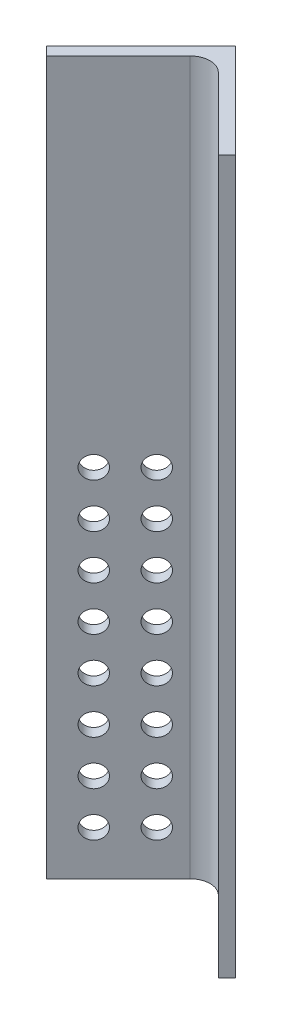
ISO-10303-21;
HEADER;
FILE_DESCRIPTION(('STEP AP214'),'2;1');
FILE_NAME('part.step','',(''),(''),'','','');
FILE_SCHEMA(('AUTOMOTIVE_DESIGN { 1 0 10303 214 1 1 1 1 }'));
ENDSEC;
DATA;
#1=APPLICATION_CONTEXT('core data for automotive mechanical design processes');
#2=APPLICATION_PROTOCOL_DEFINITION('international standard','automotive_design',2000,#1);
#3=PRODUCT_CONTEXT('',#1,'mechanical');
#4=PRODUCT('Part','Part','',(#3));
#5=PRODUCT_RELATED_PRODUCT_CATEGORY('part','',(#4));
#6=PRODUCT_DEFINITION_FORMATION('','',#4);
#7=PRODUCT_DEFINITION_CONTEXT('part definition',#1,'design');
#8=PRODUCT_DEFINITION('design','',#6,#7);
#9=PRODUCT_DEFINITION_SHAPE('','',#8);
#10=(LENGTH_UNIT() NAMED_UNIT(*) SI_UNIT(.MILLI.,.METRE.));
#11=(NAMED_UNIT(*) PLANE_ANGLE_UNIT() SI_UNIT($,.RADIAN.));
#12=(NAMED_UNIT(*) SI_UNIT($,.STERADIAN.) SOLID_ANGLE_UNIT());
#13=UNCERTAINTY_MEASURE_WITH_UNIT(LENGTH_MEASURE(1.E-05),#10,'distance_accuracy_value','');
#14=(GEOMETRIC_REPRESENTATION_CONTEXT(3) GLOBAL_UNCERTAINTY_ASSIGNED_CONTEXT((#13)) GLOBAL_UNIT_ASSIGNED_CONTEXT((#10,
#11,#12)) REPRESENTATION_CONTEXT('',''));
#15=CARTESIAN_POINT('',(0.,0.,0.));
#16=DIRECTION('',(0.,0.,1.));
#17=DIRECTION('',(1.,0.,0.));
#18=AXIS2_PLACEMENT_3D('',#15,#16,#17);
#19=CARTESIAN_POINT('',(26.9407683632075,101.6,26.9407683632075));
#20=DIRECTION('',(-0.707106781186548,0.,0.707106781186547));
#21=DIRECTION('',(0.707106781186547,0.,0.707106781186548));
#22=AXIS2_PLACEMENT_3D('',#19,#20,#21);
#23=PLANE('',#22);
#24=DIRECTION('',(-0.707106781186547,0.,-0.707106781186548));
#25=VECTOR('',#24,1.);
#26=CARTESIAN_POINT('',(26.9407683632075,-101.6,26.9407683632075));
#27=LINE('',#26,#25);
#28=CARTESIAN_POINT('',(26.9407683632075,-101.6,26.9407683632075));
#29=VERTEX_POINT('',#28);
#30=CARTESIAN_POINT('',(0.,-101.6,0.));
#31=VERTEX_POINT('',#30);
#32=EDGE_CURVE('E118',#29,#31,#27,.T.);
#33=ORIENTED_EDGE('',*,*,#32,.T.);
#34=DIRECTION('',(0.,-1.,0.));
#35=VECTOR('',#34,1.);
#36=CARTESIAN_POINT('',(0.,101.6,0.));
#37=LINE('',#36,#35);
#38=CARTESIAN_POINT('',(0.,101.6,0.));
#39=VERTEX_POINT('',#38);
#40=EDGE_CURVE('E99',#39,#31,#37,.T.);
#41=ORIENTED_EDGE('',*,*,#40,.F.);
#42=DIRECTION('',(-0.707106781186547,0.,-0.707106781186548));
#43=VECTOR('',#42,1.);
#44=CARTESIAN_POINT('',(26.9407683632075,101.6,26.9407683632075));
#45=LINE('',#44,#43);
#46=CARTESIAN_POINT('',(26.9407683632075,101.6,26.9407683632075));
#47=VERTEX_POINT('',#46);
#48=EDGE_CURVE('E106',#47,#39,#45,.T.);
#49=ORIENTED_EDGE('',*,*,#48,.F.);
#50=DIRECTION('',(0.,-1.,0.));
#51=VECTOR('',#50,1.);
#52=CARTESIAN_POINT('',(26.9407683632075,101.6,26.9407683632075));
#53=LINE('',#52,#51);
#54=EDGE_CURVE('E464',#47,#29,#53,.T.);
#55=ORIENTED_EDGE('',*,*,#54,.T.);
#56=EDGE_LOOP('',(#33,#41,#49,#55));
#57=FACE_BOUND('',#56,.T.);
#58=ADVANCED_FACE('F33',(#57),#23,.F.);
#59=CARTESIAN_POINT('',(0.,101.6,0.));
#60=DIRECTION('',(0.707106781186547,0.,0.707106781186548));
#61=DIRECTION('',(0.707106781186548,0.,-0.707106781186547));
#62=AXIS2_PLACEMENT_3D('',#59,#60,#61);
#63=PLANE('',#62);
#64=CARTESIAN_POINT('',(-11.2253201513364,0.,11.2253201513364));
#65=DIRECTION('',(0.707106781186547,0.,0.707106781186548));
#66=DIRECTION('',(0.707106781186548,0.,-0.707106781186547));
#67=AXIS2_PLACEMENT_3D('',#64,#65,#66);
#68=CIRCLE('',#67,3.17499999999999);
#69=CARTESIAN_POINT('',(-8.98025612106916,0.,8.98025612106915));
#70=VERTEX_POINT('',#69);
#71=EDGE_CURVE('E502',#70,#70,#68,.T.);
#72=ORIENTED_EDGE('',*,*,#71,.T.);
#73=EDGE_LOOP('',(#72));
#74=FACE_BOUND('',#73,.T.);
#75=CARTESIAN_POINT('',(-20.2055762724056,0.,20.2055762724056));
#76=DIRECTION('',(0.707106781186547,0.,0.707106781186548));
#77=DIRECTION('',(0.707106781186548,0.,-0.707106781186547));
#78=AXIS2_PLACEMENT_3D('',#75,#76,#77);
#79=CIRCLE('',#78,3.17499999999999);
#80=CARTESIAN_POINT('',(-17.9605122421383,0.,17.9605122421383));
#81=VERTEX_POINT('',#80);
#82=EDGE_CURVE('E472',#81,#81,#79,.T.);
#83=ORIENTED_EDGE('',*,*,#82,.T.);
#84=EDGE_LOOP('',(#83));
#85=FACE_BOUND('',#84,.T.);
#86=DIRECTION('',(-0.707106781186548,0.,0.707106781186547));
#87=VECTOR('',#86,1.);
#88=CARTESIAN_POINT('',(0.,-101.6,0.));
#89=LINE('',#88,#87);
#90=CARTESIAN_POINT('',(-26.9407683632075,-101.6,26.9407683632075));
#91=VERTEX_POINT('',#90);
#92=EDGE_CURVE('E471',#31,#91,#89,.T.);
#93=ORIENTED_EDGE('',*,*,#92,.T.);
#94=DIRECTION('',(0.,-1.,0.));
#95=VECTOR('',#94,1.);
#96=CARTESIAN_POINT('',(-26.9407683632075,101.6,26.9407683632075));
#97=LINE('',#96,#95);
#98=CARTESIAN_POINT('',(-26.9407683632075,101.6,26.9407683632075));
#99=VERTEX_POINT('',#98);
#100=EDGE_CURVE('E102',#99,#91,#97,.T.);
#101=ORIENTED_EDGE('',*,*,#100,.F.);
#102=DIRECTION('',(-0.707106781186548,0.,0.707106781186547));
#103=VECTOR('',#102,1.);
#104=CARTESIAN_POINT('',(0.,101.6,0.));
#105=LINE('',#104,#103);
#106=EDGE_CURVE('E94',#39,#99,#105,.T.);
#107=ORIENTED_EDGE('',*,*,#106,.F.);
#108=ORIENTED_EDGE('',*,*,#40,.T.);
#109=EDGE_LOOP('',(#93,#101,#107,#108));
#110=FACE_BOUND('',#109,.T.);
#111=CARTESIAN_POINT('',(-20.2055762724056,-12.7,20.2055762724056));
#112=DIRECTION('',(0.707106781186547,0.,0.707106781186548));
#113=DIRECTION('',(0.707106781186548,0.,-0.707106781186547));
#114=AXIS2_PLACEMENT_3D('',#111,#112,#113);
#115=CIRCLE('',#114,3.17499999999999);
#116=CARTESIAN_POINT('',(-17.9605122421383,-12.7,17.9605122421383));
#117=VERTEX_POINT('',#116);
#118=EDGE_CURVE('E131',#117,#117,#115,.T.);
#119=ORIENTED_EDGE('',*,*,#118,.T.);
#120=EDGE_LOOP('',(#119));
#121=FACE_BOUND('',#120,.T.);
#122=CARTESIAN_POINT('',(-11.2253201513364,-12.7,11.2253201513364));
#123=DIRECTION('',(0.707106781186547,0.,0.707106781186548));
#124=DIRECTION('',(0.707106781186548,0.,-0.707106781186547));
#125=AXIS2_PLACEMENT_3D('',#122,#123,#124);
#126=CIRCLE('',#125,3.17499999999999);
#127=CARTESIAN_POINT('',(-8.98025612106916,-12.7,8.98025612106915));
#128=VERTEX_POINT('',#127);
#129=EDGE_CURVE('E137',#128,#128,#126,.T.);
#130=ORIENTED_EDGE('',*,*,#129,.T.);
#131=EDGE_LOOP('',(#130));
#132=FACE_BOUND('',#131,.T.);
#133=CARTESIAN_POINT('',(-20.2055762724056,-25.4,20.2055762724056));
#134=DIRECTION('',(0.707106781186547,0.,0.707106781186548));
#135=DIRECTION('',(0.707106781186548,0.,-0.707106781186547));
#136=AXIS2_PLACEMENT_3D('',#133,#134,#135);
#137=CIRCLE('',#136,3.17499999999999);
#138=CARTESIAN_POINT('',(-17.9605122421383,-25.4,17.9605122421383));
#139=VERTEX_POINT('',#138);
#140=EDGE_CURVE('E143',#139,#139,#137,.T.);
#141=ORIENTED_EDGE('',*,*,#140,.T.);
#142=EDGE_LOOP('',(#141));
#143=FACE_BOUND('',#142,.T.);
#144=CARTESIAN_POINT('',(-11.2253201513364,-25.4,11.2253201513364));
#145=DIRECTION('',(0.707106781186547,0.,0.707106781186548));
#146=DIRECTION('',(0.707106781186548,0.,-0.707106781186547));
#147=AXIS2_PLACEMENT_3D('',#144,#145,#146);
#148=CIRCLE('',#147,3.17499999999999);
#149=CARTESIAN_POINT('',(-8.98025612106916,-25.4,8.98025612106915));
#150=VERTEX_POINT('',#149);
#151=EDGE_CURVE('E149',#150,#150,#148,.T.);
#152=ORIENTED_EDGE('',*,*,#151,.T.);
#153=EDGE_LOOP('',(#152));
#154=FACE_BOUND('',#153,.T.);
#155=CARTESIAN_POINT('',(-20.2055762724056,-38.1,20.2055762724056));
#156=DIRECTION('',(0.707106781186547,0.,0.707106781186548));
#157=DIRECTION('',(0.707106781186548,0.,-0.707106781186547));
#158=AXIS2_PLACEMENT_3D('',#155,#156,#157);
#159=CIRCLE('',#158,3.17499999999999);
#160=CARTESIAN_POINT('',(-17.9605122421383,-38.1,17.9605122421383));
#161=VERTEX_POINT('',#160);
#162=EDGE_CURVE('E155',#161,#161,#159,.T.);
#163=ORIENTED_EDGE('',*,*,#162,.T.);
#164=EDGE_LOOP('',(#163));
#165=FACE_BOUND('',#164,.T.);
#166=CARTESIAN_POINT('',(-11.2253201513364,-38.1,11.2253201513364));
#167=DIRECTION('',(0.707106781186547,0.,0.707106781186548));
#168=DIRECTION('',(0.707106781186548,0.,-0.707106781186547));
#169=AXIS2_PLACEMENT_3D('',#166,#167,#168);
#170=CIRCLE('',#169,3.17499999999999);
#171=CARTESIAN_POINT('',(-8.98025612106916,-38.1,8.98025612106915));
#172=VERTEX_POINT('',#171);
#173=EDGE_CURVE('E161',#172,#172,#170,.T.);
#174=ORIENTED_EDGE('',*,*,#173,.T.);
#175=EDGE_LOOP('',(#174));
#176=FACE_BOUND('',#175,.T.);
#177=CARTESIAN_POINT('',(-20.2055762724056,-50.8,20.2055762724056));
#178=DIRECTION('',(0.707106781186547,0.,0.707106781186548));
#179=DIRECTION('',(0.707106781186548,0.,-0.707106781186547));
#180=AXIS2_PLACEMENT_3D('',#177,#178,#179);
#181=CIRCLE('',#180,3.17499999999999);
#182=CARTESIAN_POINT('',(-17.9605122421383,-50.8,17.9605122421383));
#183=VERTEX_POINT('',#182);
#184=EDGE_CURVE('E167',#183,#183,#181,.T.);
#185=ORIENTED_EDGE('',*,*,#184,.T.);
#186=EDGE_LOOP('',(#185));
#187=FACE_BOUND('',#186,.T.);
#188=CARTESIAN_POINT('',(-11.2253201513364,-50.8,11.2253201513364));
#189=DIRECTION('',(0.707106781186547,0.,0.707106781186548));
#190=DIRECTION('',(0.707106781186548,0.,-0.707106781186547));
#191=AXIS2_PLACEMENT_3D('',#188,#189,#190);
#192=CIRCLE('',#191,3.17499999999999);
#193=CARTESIAN_POINT('',(-8.98025612106916,-50.8,8.98025612106915));
#194=VERTEX_POINT('',#193);
#195=EDGE_CURVE('E173',#194,#194,#192,.T.);
#196=ORIENTED_EDGE('',*,*,#195,.T.);
#197=EDGE_LOOP('',(#196));
#198=FACE_BOUND('',#197,.T.);
#199=CARTESIAN_POINT('',(-20.2055762724056,-63.5,20.2055762724056));
#200=DIRECTION('',(0.707106781186547,0.,0.707106781186548));
#201=DIRECTION('',(0.707106781186548,0.,-0.707106781186547));
#202=AXIS2_PLACEMENT_3D('',#199,#200,#201);
#203=CIRCLE('',#202,3.17499999999999);
#204=CARTESIAN_POINT('',(-17.9605122421383,-63.5,17.9605122421383));
#205=VERTEX_POINT('',#204);
#206=EDGE_CURVE('E179',#205,#205,#203,.T.);
#207=ORIENTED_EDGE('',*,*,#206,.T.);
#208=EDGE_LOOP('',(#207));
#209=FACE_BOUND('',#208,.T.);
#210=CARTESIAN_POINT('',(-11.2253201513364,-63.5,11.2253201513364));
#211=DIRECTION('',(0.707106781186547,0.,0.707106781186548));
#212=DIRECTION('',(0.707106781186548,0.,-0.707106781186547));
#213=AXIS2_PLACEMENT_3D('',#210,#211,#212);
#214=CIRCLE('',#213,3.17499999999999);
#215=CARTESIAN_POINT('',(-8.98025612106916,-63.5,8.98025612106915));
#216=VERTEX_POINT('',#215);
#217=EDGE_CURVE('E185',#216,#216,#214,.T.);
#218=ORIENTED_EDGE('',*,*,#217,.T.);
#219=EDGE_LOOP('',(#218));
#220=FACE_BOUND('',#219,.T.);
#221=CARTESIAN_POINT('',(-20.2055762724056,-76.2,20.2055762724056));
#222=DIRECTION('',(0.707106781186547,0.,0.707106781186548));
#223=DIRECTION('',(0.707106781186548,0.,-0.707106781186547));
#224=AXIS2_PLACEMENT_3D('',#221,#222,#223);
#225=CIRCLE('',#224,3.17499999999999);
#226=CARTESIAN_POINT('',(-17.9605122421383,-76.2,17.9605122421383));
#227=VERTEX_POINT('',#226);
#228=EDGE_CURVE('E191',#227,#227,#225,.T.);
#229=ORIENTED_EDGE('',*,*,#228,.T.);
#230=EDGE_LOOP('',(#229));
#231=FACE_BOUND('',#230,.T.);
#232=CARTESIAN_POINT('',(-11.2253201513364,-76.2,11.2253201513364));
#233=DIRECTION('',(0.707106781186547,0.,0.707106781186548));
#234=DIRECTION('',(0.707106781186548,0.,-0.707106781186547));
#235=AXIS2_PLACEMENT_3D('',#232,#233,#234);
#236=CIRCLE('',#235,3.17499999999999);
#237=CARTESIAN_POINT('',(-8.98025612106916,-76.2,8.98025612106915));
#238=VERTEX_POINT('',#237);
#239=EDGE_CURVE('E197',#238,#238,#236,.T.);
#240=ORIENTED_EDGE('',*,*,#239,.T.);
#241=EDGE_LOOP('',(#240));
#242=FACE_BOUND('',#241,.T.);
#243=CARTESIAN_POINT('',(-20.2055762724056,-88.9,20.2055762724056));
#244=DIRECTION('',(0.707106781186547,0.,0.707106781186548));
#245=DIRECTION('',(0.707106781186548,0.,-0.707106781186547));
#246=AXIS2_PLACEMENT_3D('',#243,#244,#245);
#247=CIRCLE('',#246,3.17499999999999);
#248=CARTESIAN_POINT('',(-17.9605122421383,-88.9,17.9605122421383));
#249=VERTEX_POINT('',#248);
#250=EDGE_CURVE('E203',#249,#249,#247,.T.);
#251=ORIENTED_EDGE('',*,*,#250,.T.);
#252=EDGE_LOOP('',(#251));
#253=FACE_BOUND('',#252,.T.);
#254=CARTESIAN_POINT('',(-11.2253201513364,-88.9,11.2253201513364));
#255=DIRECTION('',(0.707106781186547,0.,0.707106781186548));
#256=DIRECTION('',(0.707106781186548,0.,-0.707106781186547));
#257=AXIS2_PLACEMENT_3D('',#254,#255,#256);
#258=CIRCLE('',#257,3.17499999999999);
#259=CARTESIAN_POINT('',(-8.98025612106916,-88.9,8.98025612106915));
#260=VERTEX_POINT('',#259);
#261=EDGE_CURVE('E41',#260,#260,#258,.T.);
#262=ORIENTED_EDGE('',*,*,#261,.T.);
#263=EDGE_LOOP('',(#262));
#264=FACE_BOUND('',#263,.T.);
#265=ADVANCED_FACE('F96',(#74,#85,#110,#121,#132,#143,#154,#165,#176,#187,#198,#209,#220,#231,
#242,#253,#264),#63,.F.);
#266=CARTESIAN_POINT('',(-26.9407683632075,101.6,26.9407683632075));
#267=DIRECTION('',(0.707106781186548,0.,-0.707106781186547));
#268=DIRECTION('',(-0.707106781186547,0.,-0.707106781186548));
#269=AXIS2_PLACEMENT_3D('',#266,#267,#268);
#270=PLANE('',#269);
#271=DIRECTION('',(0.707106781186547,0.,0.707106781186549));
#272=VECTOR('',#271,1.);
#273=CARTESIAN_POINT('',(-26.9407683632075,-101.6,26.9407683632075));
#274=LINE('',#273,#272);
#275=CARTESIAN_POINT('',(-24.4981386982767,-101.6,29.3833980281383));
#276=VERTEX_POINT('',#275);
#277=EDGE_CURVE('E474',#91,#276,#274,.T.);
#278=ORIENTED_EDGE('',*,*,#277,.T.);
#279=DIRECTION('',(0.,-1.,0.));
#280=VECTOR('',#279,1.);
#281=CARTESIAN_POINT('',(-24.4981386982767,101.6,29.3833980281383));
#282=LINE('',#281,#280);
#283=CARTESIAN_POINT('',(-24.4981386982767,101.6,29.3833980281383));
#284=VERTEX_POINT('',#283);
#285=EDGE_CURVE('E123',#284,#276,#282,.T.);
#286=ORIENTED_EDGE('',*,*,#285,.F.);
#287=DIRECTION('',(0.707106781186547,0.,0.707106781186549));
#288=VECTOR('',#287,1.);
#289=CARTESIAN_POINT('',(-26.9407683632075,101.6,26.9407683632075));
#290=LINE('',#289,#288);
#291=EDGE_CURVE('E105',#99,#284,#290,.T.);
#292=ORIENTED_EDGE('',*,*,#291,.F.);
#293=ORIENTED_EDGE('',*,*,#100,.T.);
#294=EDGE_LOOP('',(#278,#286,#292,#293));
#295=FACE_BOUND('',#294,.T.);
#296=ADVANCED_FACE('F220',(#295),#270,.F.);
#297=CARTESIAN_POINT('',(-24.4981386982767,101.6,29.3833980281383));
#298=DIRECTION('',(-0.707106781186547,0.,-0.707106781186548));
#299=DIRECTION('',(-0.707106781186548,0.,0.707106781186547));
#300=AXIS2_PLACEMENT_3D('',#297,#298,#299);
#301=PLANE('',#300);
#302=CARTESIAN_POINT('',(-8.78269048640563,0.,13.6679498162673));
#303=DIRECTION('',(0.707106781186547,0.,0.707106781186548));
#304=DIRECTION('',(0.707106781186548,0.,-0.707106781186547));
#305=AXIS2_PLACEMENT_3D('',#302,#303,#304);
#306=CIRCLE('',#305,3.17499999999999);
#307=CARTESIAN_POINT('',(-6.53762645613835,0.,11.422885786));
#308=VERTEX_POINT('',#307);
#309=EDGE_CURVE('E499',#308,#308,#306,.T.);
#310=ORIENTED_EDGE('',*,*,#309,.F.);
#311=EDGE_LOOP('',(#310));
#312=FACE_BOUND('',#311,.T.);
#313=CARTESIAN_POINT('',(-17.7629466074748,0.,22.6482059373364));
#314=DIRECTION('',(0.707106781186547,0.,0.707106781186548));
#315=DIRECTION('',(0.707106781186548,0.,-0.707106781186547));
#316=AXIS2_PLACEMENT_3D('',#313,#314,#315);
#317=CIRCLE('',#316,3.17499999999999);
#318=CARTESIAN_POINT('',(-15.5178825772075,0.,20.4031419070691));
#319=VERTEX_POINT('',#318);
#320=EDGE_CURVE('E477',#319,#319,#317,.T.);
#321=ORIENTED_EDGE('',*,*,#320,.F.);
#322=EDGE_LOOP('',(#321));
#323=FACE_BOUND('',#322,.T.);
#324=DIRECTION('',(0.707106781186548,0.,-0.707106781186547));
#325=VECTOR('',#324,1.);
#326=CARTESIAN_POINT('',(-24.4981386982767,-101.6,29.3833980281383));
#327=LINE('',#326,#325);
#328=CARTESIAN_POINT('',(-4.04111525448112,-101.6,8.92637458434274));
#329=VERTEX_POINT('',#328);
#330=EDGE_CURVE('E483',#276,#329,#327,.T.);
#331=ORIENTED_EDGE('',*,*,#330,.T.);
#332=DIRECTION('',(0.,-1.,0.));
#333=VECTOR('',#332,1.);
#334=CARTESIAN_POINT('',(-4.04111525448112,101.6,8.92637458434274));
#335=LINE('',#334,#333);
#336=CARTESIAN_POINT('',(-4.04111525448112,101.6,8.92637458434274));
#337=VERTEX_POINT('',#336);
#338=EDGE_CURVE('E48',#329,#337,#335,.F.);
#339=ORIENTED_EDGE('',*,*,#338,.T.);
#340=DIRECTION('',(0.707106781186548,0.,-0.707106781186547));
#341=VECTOR('',#340,1.);
#342=CARTESIAN_POINT('',(-24.4981386982767,101.6,29.3833980281383));
#343=LINE('',#342,#341);
#344=EDGE_CURVE('E489',#284,#337,#343,.T.);
#345=ORIENTED_EDGE('',*,*,#344,.F.);
#346=ORIENTED_EDGE('',*,*,#285,.T.);
#347=EDGE_LOOP('',(#331,#339,#345,#346));
#348=FACE_BOUND('',#347,.T.);
#349=CARTESIAN_POINT('',(-17.7629466074748,-12.7,22.6482059373364));
#350=DIRECTION('',(0.707106781186547,0.,0.707106781186548));
#351=DIRECTION('',(0.707106781186548,0.,-0.707106781186547));
#352=AXIS2_PLACEMENT_3D('',#349,#350,#351);
#353=CIRCLE('',#352,3.17499999999999);
#354=CARTESIAN_POINT('',(-15.5178825772075,-12.7,20.4031419070691));
#355=VERTEX_POINT('',#354);
#356=EDGE_CURVE('E134',#355,#355,#353,.T.);
#357=ORIENTED_EDGE('',*,*,#356,.F.);
#358=EDGE_LOOP('',(#357));
#359=FACE_BOUND('',#358,.T.);
#360=CARTESIAN_POINT('',(-8.78269048640563,-12.7,13.6679498162673));
#361=DIRECTION('',(0.707106781186547,0.,0.707106781186548));
#362=DIRECTION('',(0.707106781186548,0.,-0.707106781186547));
#363=AXIS2_PLACEMENT_3D('',#360,#361,#362);
#364=CIRCLE('',#363,3.17499999999999);
#365=CARTESIAN_POINT('',(-6.53762645613835,-12.7,11.422885786));
#366=VERTEX_POINT('',#365);
#367=EDGE_CURVE('E140',#366,#366,#364,.T.);
#368=ORIENTED_EDGE('',*,*,#367,.F.);
#369=EDGE_LOOP('',(#368));
#370=FACE_BOUND('',#369,.T.);
#371=CARTESIAN_POINT('',(-17.7629466074748,-25.4,22.6482059373364));
#372=DIRECTION('',(0.707106781186547,0.,0.707106781186548));
#373=DIRECTION('',(0.707106781186548,0.,-0.707106781186547));
#374=AXIS2_PLACEMENT_3D('',#371,#372,#373);
#375=CIRCLE('',#374,3.17499999999999);
#376=CARTESIAN_POINT('',(-15.5178825772075,-25.4,20.4031419070691));
#377=VERTEX_POINT('',#376);
#378=EDGE_CURVE('E146',#377,#377,#375,.T.);
#379=ORIENTED_EDGE('',*,*,#378,.F.);
#380=EDGE_LOOP('',(#379));
#381=FACE_BOUND('',#380,.T.);
#382=CARTESIAN_POINT('',(-8.78269048640563,-25.4,13.6679498162673));
#383=DIRECTION('',(0.707106781186547,0.,0.707106781186548));
#384=DIRECTION('',(0.707106781186548,0.,-0.707106781186547));
#385=AXIS2_PLACEMENT_3D('',#382,#383,#384);
#386=CIRCLE('',#385,3.17499999999999);
#387=CARTESIAN_POINT('',(-6.53762645613835,-25.4,11.422885786));
#388=VERTEX_POINT('',#387);
#389=EDGE_CURVE('E152',#388,#388,#386,.T.);
#390=ORIENTED_EDGE('',*,*,#389,.F.);
#391=EDGE_LOOP('',(#390));
#392=FACE_BOUND('',#391,.T.);
#393=CARTESIAN_POINT('',(-17.7629466074748,-38.1,22.6482059373364));
#394=DIRECTION('',(0.707106781186547,0.,0.707106781186548));
#395=DIRECTION('',(0.707106781186548,0.,-0.707106781186547));
#396=AXIS2_PLACEMENT_3D('',#393,#394,#395);
#397=CIRCLE('',#396,3.17499999999999);
#398=CARTESIAN_POINT('',(-15.5178825772075,-38.1,20.4031419070691));
#399=VERTEX_POINT('',#398);
#400=EDGE_CURVE('E158',#399,#399,#397,.T.);
#401=ORIENTED_EDGE('',*,*,#400,.F.);
#402=EDGE_LOOP('',(#401));
#403=FACE_BOUND('',#402,.T.);
#404=CARTESIAN_POINT('',(-8.78269048640563,-38.1,13.6679498162673));
#405=DIRECTION('',(0.707106781186547,0.,0.707106781186548));
#406=DIRECTION('',(0.707106781186548,0.,-0.707106781186547));
#407=AXIS2_PLACEMENT_3D('',#404,#405,#406);
#408=CIRCLE('',#407,3.17499999999999);
#409=CARTESIAN_POINT('',(-6.53762645613835,-38.1,11.422885786));
#410=VERTEX_POINT('',#409);
#411=EDGE_CURVE('E164',#410,#410,#408,.T.);
#412=ORIENTED_EDGE('',*,*,#411,.F.);
#413=EDGE_LOOP('',(#412));
#414=FACE_BOUND('',#413,.T.);
#415=CARTESIAN_POINT('',(-17.7629466074748,-50.8,22.6482059373364));
#416=DIRECTION('',(0.707106781186547,0.,0.707106781186548));
#417=DIRECTION('',(0.707106781186548,0.,-0.707106781186547));
#418=AXIS2_PLACEMENT_3D('',#415,#416,#417);
#419=CIRCLE('',#418,3.17499999999999);
#420=CARTESIAN_POINT('',(-15.5178825772075,-50.8,20.4031419070691));
#421=VERTEX_POINT('',#420);
#422=EDGE_CURVE('E170',#421,#421,#419,.T.);
#423=ORIENTED_EDGE('',*,*,#422,.F.);
#424=EDGE_LOOP('',(#423));
#425=FACE_BOUND('',#424,.T.);
#426=CARTESIAN_POINT('',(-8.78269048640563,-50.8,13.6679498162673));
#427=DIRECTION('',(0.707106781186547,0.,0.707106781186548));
#428=DIRECTION('',(0.707106781186548,0.,-0.707106781186547));
#429=AXIS2_PLACEMENT_3D('',#426,#427,#428);
#430=CIRCLE('',#429,3.17499999999999);
#431=CARTESIAN_POINT('',(-6.53762645613835,-50.8,11.422885786));
#432=VERTEX_POINT('',#431);
#433=EDGE_CURVE('E176',#432,#432,#430,.T.);
#434=ORIENTED_EDGE('',*,*,#433,.F.);
#435=EDGE_LOOP('',(#434));
#436=FACE_BOUND('',#435,.T.);
#437=CARTESIAN_POINT('',(-17.7629466074748,-63.5,22.6482059373364));
#438=DIRECTION('',(0.707106781186547,0.,0.707106781186548));
#439=DIRECTION('',(0.707106781186548,0.,-0.707106781186547));
#440=AXIS2_PLACEMENT_3D('',#437,#438,#439);
#441=CIRCLE('',#440,3.17499999999999);
#442=CARTESIAN_POINT('',(-15.5178825772075,-63.5,20.4031419070691));
#443=VERTEX_POINT('',#442);
#444=EDGE_CURVE('E182',#443,#443,#441,.T.);
#445=ORIENTED_EDGE('',*,*,#444,.F.);
#446=EDGE_LOOP('',(#445));
#447=FACE_BOUND('',#446,.T.);
#448=CARTESIAN_POINT('',(-8.78269048640563,-63.5,13.6679498162673));
#449=DIRECTION('',(0.707106781186547,0.,0.707106781186548));
#450=DIRECTION('',(0.707106781186548,0.,-0.707106781186547));
#451=AXIS2_PLACEMENT_3D('',#448,#449,#450);
#452=CIRCLE('',#451,3.17499999999999);
#453=CARTESIAN_POINT('',(-6.53762645613835,-63.5,11.422885786));
#454=VERTEX_POINT('',#453);
#455=EDGE_CURVE('E188',#454,#454,#452,.T.);
#456=ORIENTED_EDGE('',*,*,#455,.F.);
#457=EDGE_LOOP('',(#456));
#458=FACE_BOUND('',#457,.T.);
#459=CARTESIAN_POINT('',(-17.7629466074748,-76.2,22.6482059373364));
#460=DIRECTION('',(0.707106781186547,0.,0.707106781186548));
#461=DIRECTION('',(0.707106781186548,0.,-0.707106781186547));
#462=AXIS2_PLACEMENT_3D('',#459,#460,#461);
#463=CIRCLE('',#462,3.17499999999999);
#464=CARTESIAN_POINT('',(-15.5178825772075,-76.2,20.4031419070691));
#465=VERTEX_POINT('',#464);
#466=EDGE_CURVE('E194',#465,#465,#463,.T.);
#467=ORIENTED_EDGE('',*,*,#466,.F.);
#468=EDGE_LOOP('',(#467));
#469=FACE_BOUND('',#468,.T.);
#470=CARTESIAN_POINT('',(-8.78269048640563,-76.2,13.6679498162673));
#471=DIRECTION('',(0.707106781186547,0.,0.707106781186548));
#472=DIRECTION('',(0.707106781186548,0.,-0.707106781186547));
#473=AXIS2_PLACEMENT_3D('',#470,#471,#472);
#474=CIRCLE('',#473,3.17499999999999);
#475=CARTESIAN_POINT('',(-6.53762645613835,-76.2,11.422885786));
#476=VERTEX_POINT('',#475);
#477=EDGE_CURVE('E200',#476,#476,#474,.T.);
#478=ORIENTED_EDGE('',*,*,#477,.F.);
#479=EDGE_LOOP('',(#478));
#480=FACE_BOUND('',#479,.T.);
#481=CARTESIAN_POINT('',(-17.7629466074748,-88.9,22.6482059373364));
#482=DIRECTION('',(0.707106781186547,0.,0.707106781186548));
#483=DIRECTION('',(0.707106781186548,0.,-0.707106781186547));
#484=AXIS2_PLACEMENT_3D('',#481,#482,#483);
#485=CIRCLE('',#484,3.17499999999999);
#486=CARTESIAN_POINT('',(-15.5178825772075,-88.9,20.4031419070691));
#487=VERTEX_POINT('',#486);
#488=EDGE_CURVE('E206',#487,#487,#485,.T.);
#489=ORIENTED_EDGE('',*,*,#488,.F.);
#490=EDGE_LOOP('',(#489));
#491=FACE_BOUND('',#490,.T.);
#492=CARTESIAN_POINT('',(-8.78269048640563,-88.9,13.6679498162673));
#493=DIRECTION('',(0.707106781186547,0.,0.707106781186548));
#494=DIRECTION('',(0.707106781186548,0.,-0.707106781186547));
#495=AXIS2_PLACEMENT_3D('',#492,#493,#494);
#496=CIRCLE('',#495,3.17499999999999);
#497=CARTESIAN_POINT('',(-6.53762645613835,-88.9,11.422885786));
#498=VERTEX_POINT('',#497);
#499=EDGE_CURVE('E11',#498,#498,#496,.T.);
#500=ORIENTED_EDGE('',*,*,#499,.F.);
#501=EDGE_LOOP('',(#500));
#502=FACE_BOUND('',#501,.T.);
#503=ADVANCED_FACE('F217',(#312,#323,#348,#359,#370,#381,#392,#403,#414,#425,#436,#447,#458,
#469,#480,#491,#502),#301,.F.);
#504=CARTESIAN_POINT('',(0.,101.6,4.88525932986162));
#505=DIRECTION('',(0.707106781186548,0.,-0.707106781186547));
#506=DIRECTION('',(-0.707106781186547,0.,-0.707106781186548));
#507=AXIS2_PLACEMENT_3D('',#504,#505,#506);
#508=PLANE('',#507);
#509=DIRECTION('',(0.707106781186547,0.,0.707106781186548));
#510=VECTOR('',#509,1.);
#511=CARTESIAN_POINT('',(0.,101.6,4.88525932986162));
#512=LINE('',#511,#510);
#513=CARTESIAN_POINT('',(4.04111525448112,101.6,8.92637458434274));
#514=VERTEX_POINT('',#513);
#515=CARTESIAN_POINT('',(24.4981386982766,101.6,29.3833980281383));
#516=VERTEX_POINT('',#515);
#517=EDGE_CURVE('E491',#514,#516,#512,.T.);
#518=ORIENTED_EDGE('',*,*,#517,.F.);
#519=DIRECTION('',(0.,-1.,0.));
#520=VECTOR('',#519,1.);
#521=CARTESIAN_POINT('',(4.04111525448112,-101.6,8.92637458434274));
#522=LINE('',#521,#520);
#523=CARTESIAN_POINT('',(4.04111525448112,-101.6,8.92637458434274));
#524=VERTEX_POINT('',#523);
#525=EDGE_CURVE('E119',#514,#524,#522,.T.);
#526=ORIENTED_EDGE('',*,*,#525,.T.);
#527=DIRECTION('',(0.707106781186547,0.,0.707106781186548));
#528=VECTOR('',#527,1.);
#529=CARTESIAN_POINT('',(0.,-101.6,4.88525932986162));
#530=LINE('',#529,#528);
#531=CARTESIAN_POINT('',(24.4981386982766,-101.6,29.3833980281383));
#532=VERTEX_POINT('',#531);
#533=EDGE_CURVE('E467',#524,#532,#530,.T.);
#534=ORIENTED_EDGE('',*,*,#533,.T.);
#535=DIRECTION('',(0.,-1.,0.));
#536=VECTOR('',#535,1.);
#537=CARTESIAN_POINT('',(24.4981386982766,101.6,29.3833980281383));
#538=LINE('',#537,#536);
#539=EDGE_CURVE('E466',#516,#532,#538,.T.);
#540=ORIENTED_EDGE('',*,*,#539,.F.);
#541=EDGE_LOOP('',(#518,#526,#534,#540));
#542=FACE_BOUND('',#541,.T.);
#543=ADVANCED_FACE('F219',(#542),#508,.F.);
#544=CARTESIAN_POINT('',(24.4981386982766,101.6,29.3833980281383));
#545=DIRECTION('',(-0.707106781186547,0.,-0.707106781186548));
#546=DIRECTION('',(-0.707106781186548,0.,0.707106781186547));
#547=AXIS2_PLACEMENT_3D('',#544,#545,#546);
#548=PLANE('',#547);
#549=DIRECTION('',(0.707106781186548,0.,-0.707106781186547));
#550=VECTOR('',#549,1.);
#551=CARTESIAN_POINT('',(24.4981386982766,-101.6,29.3833980281383));
#552=LINE('',#551,#550);
#553=EDGE_CURVE('E115',#532,#29,#552,.T.);
#554=ORIENTED_EDGE('',*,*,#553,.T.);
#555=ORIENTED_EDGE('',*,*,#54,.F.);
#556=DIRECTION('',(0.707106781186548,0.,-0.707106781186547));
#557=VECTOR('',#556,1.);
#558=CARTESIAN_POINT('',(24.4981386982766,101.6,29.3833980281383));
#559=LINE('',#558,#557);
#560=EDGE_CURVE('E111',#516,#47,#559,.T.);
#561=ORIENTED_EDGE('',*,*,#560,.F.);
#562=ORIENTED_EDGE('',*,*,#539,.T.);
#563=EDGE_LOOP('',(#554,#555,#561,#562));
#564=FACE_BOUND('',#563,.T.);
#565=ADVANCED_FACE('F227',(#564),#548,.F.);
#566=CARTESIAN_POINT('',(0.,101.6,0.));
#567=DIRECTION('',(0.,1.,0.));
#568=DIRECTION('',(0.,0.,1.));
#569=AXIS2_PLACEMENT_3D('',#566,#567,#568);
#570=PLANE('',#569);
#571=ORIENTED_EDGE('',*,*,#48,.T.);
#572=ORIENTED_EDGE('',*,*,#106,.T.);
#573=ORIENTED_EDGE('',*,*,#291,.T.);
#574=ORIENTED_EDGE('',*,*,#344,.T.);
#575=CARTESIAN_POINT('',(0.,101.6,12.9674898388239));
#576=DIRECTION('',(0.,1.,0.));
#577=DIRECTION('',(0.,0.,1.));
#578=AXIS2_PLACEMENT_3D('',#575,#576,#577);
#579=CIRCLE('',#578,5.715);
#580=EDGE_CURVE('E129',#337,#514,#579,.F.);
#581=ORIENTED_EDGE('',*,*,#580,.T.);
#582=ORIENTED_EDGE('',*,*,#517,.T.);
#583=ORIENTED_EDGE('',*,*,#560,.T.);
#584=EDGE_LOOP('',(#571,#572,#573,#574,#581,#582,#583));
#585=FACE_BOUND('',#584,.T.);
#586=ADVANCED_FACE('F109',(#585),#570,.T.);
#587=CARTESIAN_POINT('',(0.,-101.6,0.));
#588=DIRECTION('',(0.,1.,0.));
#589=DIRECTION('',(0.,0.,1.));
#590=AXIS2_PLACEMENT_3D('',#587,#588,#589);
#591=PLANE('',#590);
#592=ORIENTED_EDGE('',*,*,#32,.F.);
#593=ORIENTED_EDGE('',*,*,#553,.F.);
#594=ORIENTED_EDGE('',*,*,#533,.F.);
#595=CARTESIAN_POINT('',(0.,-101.6,12.9674898388239));
#596=DIRECTION('',(0.,1.,0.));
#597=DIRECTION('',(0.,0.,1.));
#598=AXIS2_PLACEMENT_3D('',#595,#596,#597);
#599=CIRCLE('',#598,5.715);
#600=EDGE_CURVE('E56',#524,#329,#599,.T.);
#601=ORIENTED_EDGE('',*,*,#600,.T.);
#602=ORIENTED_EDGE('',*,*,#330,.F.);
#603=ORIENTED_EDGE('',*,*,#277,.F.);
#604=ORIENTED_EDGE('',*,*,#92,.F.);
#605=EDGE_LOOP('',(#592,#593,#594,#601,#602,#603,#604));
#606=FACE_BOUND('',#605,.T.);
#607=ADVANCED_FACE('F246',(#606),#591,.F.);
#608=CARTESIAN_POINT('',(0.,101.6,12.9674898388239));
#609=DIRECTION('',(0.,1.,0.));
#610=DIRECTION('',(0.,0.,1.));
#611=AXIS2_PLACEMENT_3D('',#608,#609,#610);
#612=CYLINDRICAL_SURFACE('',#611,5.715);
#613=ORIENTED_EDGE('',*,*,#580,.F.);
#614=ORIENTED_EDGE('',*,*,#338,.F.);
#615=ORIENTED_EDGE('',*,*,#600,.F.);
#616=ORIENTED_EDGE('',*,*,#525,.F.);
#617=EDGE_LOOP('',(#613,#614,#615,#616));
#618=FACE_BOUND('',#617,.T.);
#619=ADVANCED_FACE('F242',(#618),#612,.F.);
#620=CARTESIAN_POINT('',(-17.7629466074748,0.,22.6482059373364));
#621=DIRECTION('',(0.707106781186547,0.,0.707106781186548));
#622=DIRECTION('',(0.707106781186548,0.,-0.707106781186547));
#623=AXIS2_PLACEMENT_3D('',#620,#621,#622);
#624=CYLINDRICAL_SURFACE('',#623,3.17499999999999);
#625=ORIENTED_EDGE('',*,*,#82,.F.);
#626=EDGE_LOOP('',(#625));
#627=FACE_BOUND('',#626,.T.);
#628=ORIENTED_EDGE('',*,*,#320,.T.);
#629=EDGE_LOOP('',(#628));
#630=FACE_BOUND('',#629,.T.);
#631=ADVANCED_FACE('F245',(#627,#630),#624,.F.);
#632=CARTESIAN_POINT('',(-8.78269048640563,0.,13.6679498162673));
#633=DIRECTION('',(0.707106781186547,0.,0.707106781186548));
#634=DIRECTION('',(0.707106781186548,0.,-0.707106781186547));
#635=AXIS2_PLACEMENT_3D('',#632,#633,#634);
#636=CYLINDRICAL_SURFACE('',#635,3.17499999999999);
#637=ORIENTED_EDGE('',*,*,#71,.F.);
#638=EDGE_LOOP('',(#637));
#639=FACE_BOUND('',#638,.T.);
#640=ORIENTED_EDGE('',*,*,#309,.T.);
#641=EDGE_LOOP('',(#640));
#642=FACE_BOUND('',#641,.T.);
#643=ADVANCED_FACE('F252',(#639,#642),#636,.F.);
#644=CARTESIAN_POINT('',(-17.7629466074748,-12.7,22.6482059373364));
#645=DIRECTION('',(0.707106781186547,0.,0.707106781186548));
#646=DIRECTION('',(0.707106781186548,0.,-0.707106781186547));
#647=AXIS2_PLACEMENT_3D('',#644,#645,#646);
#648=CYLINDRICAL_SURFACE('',#647,3.17499999999999);
#649=ORIENTED_EDGE('',*,*,#118,.F.);
#650=EDGE_LOOP('',(#649));
#651=FACE_BOUND('',#650,.T.);
#652=ORIENTED_EDGE('',*,*,#356,.T.);
#653=EDGE_LOOP('',(#652));
#654=FACE_BOUND('',#653,.T.);
#655=ADVANCED_FACE('F248',(#651,#654),#648,.F.);
#656=CARTESIAN_POINT('',(-8.78269048640563,-12.7,13.6679498162673));
#657=DIRECTION('',(0.707106781186547,0.,0.707106781186548));
#658=DIRECTION('',(0.707106781186548,0.,-0.707106781186547));
#659=AXIS2_PLACEMENT_3D('',#656,#657,#658);
#660=CYLINDRICAL_SURFACE('',#659,3.17499999999999);
#661=ORIENTED_EDGE('',*,*,#129,.F.);
#662=EDGE_LOOP('',(#661));
#663=FACE_BOUND('',#662,.T.);
#664=ORIENTED_EDGE('',*,*,#367,.T.);
#665=EDGE_LOOP('',(#664));
#666=FACE_BOUND('',#665,.T.);
#667=ADVANCED_FACE('F251',(#663,#666),#660,.F.);
#668=CARTESIAN_POINT('',(-17.7629466074748,-25.4,22.6482059373364));
#669=DIRECTION('',(0.707106781186547,0.,0.707106781186548));
#670=DIRECTION('',(0.707106781186548,0.,-0.707106781186547));
#671=AXIS2_PLACEMENT_3D('',#668,#669,#670);
#672=CYLINDRICAL_SURFACE('',#671,3.17499999999999);
#673=ORIENTED_EDGE('',*,*,#140,.F.);
#674=EDGE_LOOP('',(#673));
#675=FACE_BOUND('',#674,.T.);
#676=ORIENTED_EDGE('',*,*,#378,.T.);
#677=EDGE_LOOP('',(#676));
#678=FACE_BOUND('',#677,.T.);
#679=ADVANCED_FACE('F256',(#675,#678),#672,.F.);
#680=CARTESIAN_POINT('',(-8.78269048640563,-25.4,13.6679498162673));
#681=DIRECTION('',(0.707106781186547,0.,0.707106781186548));
#682=DIRECTION('',(0.707106781186548,0.,-0.707106781186547));
#683=AXIS2_PLACEMENT_3D('',#680,#681,#682);
#684=CYLINDRICAL_SURFACE('',#683,3.17499999999999);
#685=ORIENTED_EDGE('',*,*,#151,.F.);
#686=EDGE_LOOP('',(#685));
#687=FACE_BOUND('',#686,.T.);
#688=ORIENTED_EDGE('',*,*,#389,.T.);
#689=EDGE_LOOP('',(#688));
#690=FACE_BOUND('',#689,.T.);
#691=ADVANCED_FACE('F260',(#687,#690),#684,.F.);
#692=CARTESIAN_POINT('',(-17.7629466074748,-38.1,22.6482059373364));
#693=DIRECTION('',(0.707106781186547,0.,0.707106781186548));
#694=DIRECTION('',(0.707106781186548,0.,-0.707106781186547));
#695=AXIS2_PLACEMENT_3D('',#692,#693,#694);
#696=CYLINDRICAL_SURFACE('',#695,3.17499999999999);
#697=ORIENTED_EDGE('',*,*,#162,.F.);
#698=EDGE_LOOP('',(#697));
#699=FACE_BOUND('',#698,.T.);
#700=ORIENTED_EDGE('',*,*,#400,.T.);
#701=EDGE_LOOP('',(#700));
#702=FACE_BOUND('',#701,.T.);
#703=ADVANCED_FACE('F264',(#699,#702),#696,.F.);
#704=CARTESIAN_POINT('',(-8.78269048640563,-38.1,13.6679498162673));
#705=DIRECTION('',(0.707106781186547,0.,0.707106781186548));
#706=DIRECTION('',(0.707106781186548,0.,-0.707106781186547));
#707=AXIS2_PLACEMENT_3D('',#704,#705,#706);
#708=CYLINDRICAL_SURFACE('',#707,3.17499999999999);
#709=ORIENTED_EDGE('',*,*,#173,.F.);
#710=EDGE_LOOP('',(#709));
#711=FACE_BOUND('',#710,.T.);
#712=ORIENTED_EDGE('',*,*,#411,.T.);
#713=EDGE_LOOP('',(#712));
#714=FACE_BOUND('',#713,.T.);
#715=ADVANCED_FACE('F268',(#711,#714),#708,.F.);
#716=CARTESIAN_POINT('',(-17.7629466074748,-50.8,22.6482059373364));
#717=DIRECTION('',(0.707106781186547,0.,0.707106781186548));
#718=DIRECTION('',(0.707106781186548,0.,-0.707106781186547));
#719=AXIS2_PLACEMENT_3D('',#716,#717,#718);
#720=CYLINDRICAL_SURFACE('',#719,3.17499999999999);
#721=ORIENTED_EDGE('',*,*,#184,.F.);
#722=EDGE_LOOP('',(#721));
#723=FACE_BOUND('',#722,.T.);
#724=ORIENTED_EDGE('',*,*,#422,.T.);
#725=EDGE_LOOP('',(#724));
#726=FACE_BOUND('',#725,.T.);
#727=ADVANCED_FACE('F272',(#723,#726),#720,.F.);
#728=CARTESIAN_POINT('',(-8.78269048640563,-50.8,13.6679498162673));
#729=DIRECTION('',(0.707106781186547,0.,0.707106781186548));
#730=DIRECTION('',(0.707106781186548,0.,-0.707106781186547));
#731=AXIS2_PLACEMENT_3D('',#728,#729,#730);
#732=CYLINDRICAL_SURFACE('',#731,3.17499999999999);
#733=ORIENTED_EDGE('',*,*,#195,.F.);
#734=EDGE_LOOP('',(#733));
#735=FACE_BOUND('',#734,.T.);
#736=ORIENTED_EDGE('',*,*,#433,.T.);
#737=EDGE_LOOP('',(#736));
#738=FACE_BOUND('',#737,.T.);
#739=ADVANCED_FACE('F276',(#735,#738),#732,.F.);
#740=CARTESIAN_POINT('',(-17.7629466074748,-63.5,22.6482059373364));
#741=DIRECTION('',(0.707106781186547,0.,0.707106781186548));
#742=DIRECTION('',(0.707106781186548,0.,-0.707106781186547));
#743=AXIS2_PLACEMENT_3D('',#740,#741,#742);
#744=CYLINDRICAL_SURFACE('',#743,3.17499999999999);
#745=ORIENTED_EDGE('',*,*,#206,.F.);
#746=EDGE_LOOP('',(#745));
#747=FACE_BOUND('',#746,.T.);
#748=ORIENTED_EDGE('',*,*,#444,.T.);
#749=EDGE_LOOP('',(#748));
#750=FACE_BOUND('',#749,.T.);
#751=ADVANCED_FACE('F280',(#747,#750),#744,.F.);
#752=CARTESIAN_POINT('',(-8.78269048640563,-63.5,13.6679498162673));
#753=DIRECTION('',(0.707106781186547,0.,0.707106781186548));
#754=DIRECTION('',(0.707106781186548,0.,-0.707106781186547));
#755=AXIS2_PLACEMENT_3D('',#752,#753,#754);
#756=CYLINDRICAL_SURFACE('',#755,3.17499999999999);
#757=ORIENTED_EDGE('',*,*,#217,.F.);
#758=EDGE_LOOP('',(#757));
#759=FACE_BOUND('',#758,.T.);
#760=ORIENTED_EDGE('',*,*,#455,.T.);
#761=EDGE_LOOP('',(#760));
#762=FACE_BOUND('',#761,.T.);
#763=ADVANCED_FACE('F284',(#759,#762),#756,.F.);
#764=CARTESIAN_POINT('',(-17.7629466074748,-76.2,22.6482059373364));
#765=DIRECTION('',(0.707106781186547,0.,0.707106781186548));
#766=DIRECTION('',(0.707106781186548,0.,-0.707106781186547));
#767=AXIS2_PLACEMENT_3D('',#764,#765,#766);
#768=CYLINDRICAL_SURFACE('',#767,3.17499999999999);
#769=ORIENTED_EDGE('',*,*,#228,.F.);
#770=EDGE_LOOP('',(#769));
#771=FACE_BOUND('',#770,.T.);
#772=ORIENTED_EDGE('',*,*,#466,.T.);
#773=EDGE_LOOP('',(#772));
#774=FACE_BOUND('',#773,.T.);
#775=ADVANCED_FACE('F288',(#771,#774),#768,.F.);
#776=CARTESIAN_POINT('',(-8.78269048640563,-76.2,13.6679498162673));
#777=DIRECTION('',(0.707106781186547,0.,0.707106781186548));
#778=DIRECTION('',(0.707106781186548,0.,-0.707106781186547));
#779=AXIS2_PLACEMENT_3D('',#776,#777,#778);
#780=CYLINDRICAL_SURFACE('',#779,3.17499999999999);
#781=ORIENTED_EDGE('',*,*,#239,.F.);
#782=EDGE_LOOP('',(#781));
#783=FACE_BOUND('',#782,.T.);
#784=ORIENTED_EDGE('',*,*,#477,.T.);
#785=EDGE_LOOP('',(#784));
#786=FACE_BOUND('',#785,.T.);
#787=ADVANCED_FACE('F292',(#783,#786),#780,.F.);
#788=CARTESIAN_POINT('',(-17.7629466074748,-88.9,22.6482059373364));
#789=DIRECTION('',(0.707106781186547,0.,0.707106781186548));
#790=DIRECTION('',(0.707106781186548,0.,-0.707106781186547));
#791=AXIS2_PLACEMENT_3D('',#788,#789,#790);
#792=CYLINDRICAL_SURFACE('',#791,3.17499999999999);
#793=ORIENTED_EDGE('',*,*,#250,.F.);
#794=EDGE_LOOP('',(#793));
#795=FACE_BOUND('',#794,.T.);
#796=ORIENTED_EDGE('',*,*,#488,.T.);
#797=EDGE_LOOP('',(#796));
#798=FACE_BOUND('',#797,.T.);
#799=ADVANCED_FACE('F214',(#795,#798),#792,.F.);
#800=CARTESIAN_POINT('',(-8.78269048640563,-88.9,13.6679498162673));
#801=DIRECTION('',(0.707106781186547,0.,0.707106781186548));
#802=DIRECTION('',(0.707106781186548,0.,-0.707106781186547));
#803=AXIS2_PLACEMENT_3D('',#800,#801,#802);
#804=CYLINDRICAL_SURFACE('',#803,3.17499999999999);
#805=ORIENTED_EDGE('',*,*,#261,.F.);
#806=EDGE_LOOP('',(#805));
#807=FACE_BOUND('',#806,.T.);
#808=ORIENTED_EDGE('',*,*,#499,.T.);
#809=EDGE_LOOP('',(#808));
#810=FACE_BOUND('',#809,.T.);
#811=ADVANCED_FACE('F35',(#807,#810),#804,.F.);
#812=CLOSED_SHELL('',(#58,#265,#296,#503,#543,#565,#586,#607,#619,#631,#643,#655,#667,#679,#691,
#703,#715,#727,#739,#751,#763,#775,#787,#799,#811));
#813=MANIFOLD_SOLID_BREP('B2',#812);
#814=ADVANCED_BREP_SHAPE_REPRESENTATION('',(#18,#813),#14);
#815=SHAPE_DEFINITION_REPRESENTATION(#9,#814);
ENDSEC;
END-ISO-10303-21;
